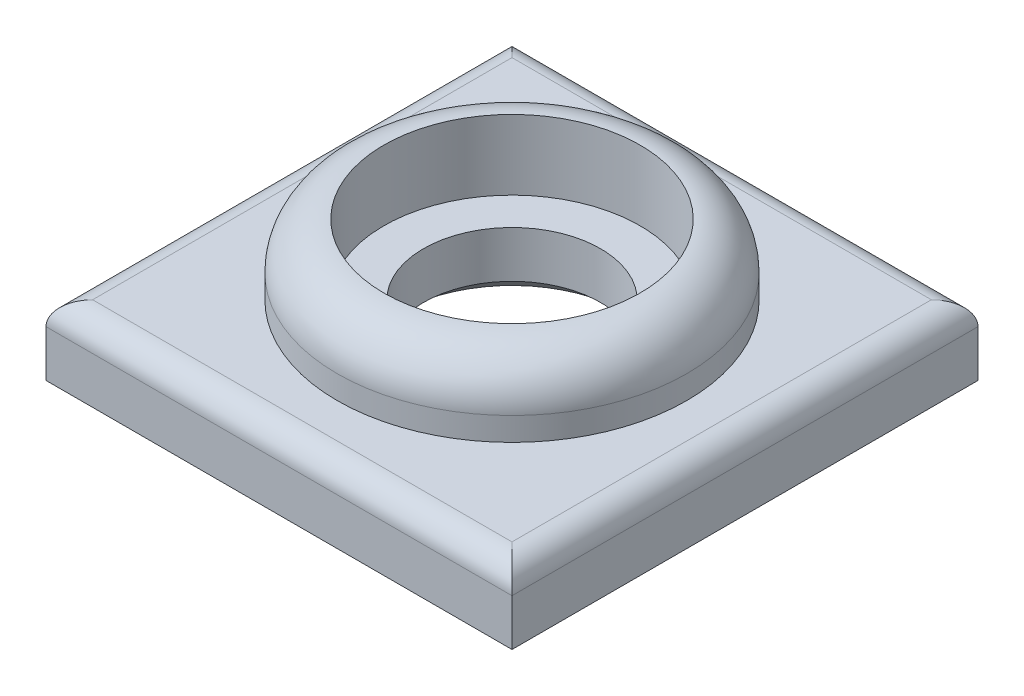
ISO-10303-21;
HEADER;
FILE_DESCRIPTION(('STEP AP214'),'2;1');
FILE_NAME('part.step','',(''),(''),'','','');
FILE_SCHEMA(('AUTOMOTIVE_DESIGN { 1 0 10303 214 1 1 1 1 }'));
ENDSEC;
DATA;
#1=APPLICATION_CONTEXT('core data for automotive mechanical design processes');
#2=APPLICATION_PROTOCOL_DEFINITION('international standard','automotive_design',2000,#1);
#3=PRODUCT_CONTEXT('',#1,'mechanical');
#4=PRODUCT('Part','Part','',(#3));
#5=PRODUCT_RELATED_PRODUCT_CATEGORY('part','',(#4));
#6=PRODUCT_DEFINITION_FORMATION('','',#4);
#7=PRODUCT_DEFINITION_CONTEXT('part definition',#1,'design');
#8=PRODUCT_DEFINITION('design','',#6,#7);
#9=PRODUCT_DEFINITION_SHAPE('','',#8);
#10=(LENGTH_UNIT() NAMED_UNIT(*) SI_UNIT(.MILLI.,.METRE.));
#11=(NAMED_UNIT(*) PLANE_ANGLE_UNIT() SI_UNIT($,.RADIAN.));
#12=(NAMED_UNIT(*) SI_UNIT($,.STERADIAN.) SOLID_ANGLE_UNIT());
#13=UNCERTAINTY_MEASURE_WITH_UNIT(LENGTH_MEASURE(1.E-05),#10,'distance_accuracy_value','');
#14=(GEOMETRIC_REPRESENTATION_CONTEXT(3) GLOBAL_UNCERTAINTY_ASSIGNED_CONTEXT((#13)) GLOBAL_UNIT_ASSIGNED_CONTEXT((#10,
#11,#12)) REPRESENTATION_CONTEXT('',''));
#15=CARTESIAN_POINT('',(0.,0.,0.));
#16=DIRECTION('',(0.,0.,1.));
#17=DIRECTION('',(1.,0.,0.));
#18=AXIS2_PLACEMENT_3D('',#15,#16,#17);
#19=CARTESIAN_POINT('',(0.,3.,0.));
#20=DIRECTION('',(0.,1.,0.));
#21=DIRECTION('',(0.,0.,1.));
#22=AXIS2_PLACEMENT_3D('',#19,#20,#21);
#23=PLANE('',#22);
#24=CARTESIAN_POINT('',(0.,3.,0.));
#25=DIRECTION('',(0.,1.,0.));
#26=DIRECTION('',(0.,0.,1.));
#27=AXIS2_PLACEMENT_3D('',#24,#25,#26);
#28=CIRCLE('',#27,3.8);
#29=CARTESIAN_POINT('',(0.,3.,3.8));
#30=VERTEX_POINT('',#29);
#31=EDGE_CURVE('E114',#30,#30,#28,.T.);
#32=ORIENTED_EDGE('',*,*,#31,.F.);
#33=EDGE_LOOP('',(#32));
#34=FACE_BOUND('',#33,.T.);
#35=CARTESIAN_POINT('',(0.,3.,0.));
#36=DIRECTION('',(0.,1.,0.));
#37=DIRECTION('',(0.,0.,1.));
#38=AXIS2_PLACEMENT_3D('',#35,#36,#37);
#39=CIRCLE('',#38,5.5);
#40=CARTESIAN_POINT('',(0.,3.,5.5));
#41=VERTEX_POINT('',#40);
#42=EDGE_CURVE('E43',#41,#41,#39,.F.);
#43=ORIENTED_EDGE('',*,*,#42,.F.);
#44=EDGE_LOOP('',(#43));
#45=FACE_BOUND('',#44,.T.);
#46=ADVANCED_FACE('F35',(#34,#45),#23,.T.);
#47=CARTESIAN_POINT('',(0.,3.,0.));
#48=DIRECTION('',(0.,1.,0.));
#49=DIRECTION('',(0.,0.,1.));
#50=AXIS2_PLACEMENT_3D('',#47,#48,#49);
#51=CIRCLE('',#50,7.5);
#52=CARTESIAN_POINT('',(0.,3.,7.5));
#53=VERTEX_POINT('',#52);
#54=EDGE_CURVE('E145',#53,#53,#51,.T.);
#55=ORIENTED_EDGE('',*,*,#54,.F.);
#56=EDGE_LOOP('',(#55));
#57=FACE_BOUND('',#56,.T.);
#58=DIRECTION('',(-1.,0.,0.));
#59=VECTOR('',#58,1.);
#60=CARTESIAN_POINT('',(-10.,3.,-9.));
#61=LINE('',#60,#59);
#62=CARTESIAN_POINT('',(9.00000000000001,3.,-9.));
#63=VERTEX_POINT('',#62);
#64=CARTESIAN_POINT('',(-9.,3.,-9.));
#65=VERTEX_POINT('',#64);
#66=EDGE_CURVE('E129',#63,#65,#61,.T.);
#67=ORIENTED_EDGE('',*,*,#66,.T.);
#68=DIRECTION('',(0.,0.,1.));
#69=VECTOR('',#68,1.);
#70=CARTESIAN_POINT('',(-9.,3.,10.));
#71=LINE('',#70,#69);
#72=CARTESIAN_POINT('',(-9.,3.,9.));
#73=VERTEX_POINT('',#72);
#74=EDGE_CURVE('E133',#65,#73,#71,.T.);
#75=ORIENTED_EDGE('',*,*,#74,.T.);
#76=DIRECTION('',(1.,0.,0.));
#77=VECTOR('',#76,1.);
#78=CARTESIAN_POINT('',(10.,3.,9.));
#79=LINE('',#78,#77);
#80=CARTESIAN_POINT('',(9.00000000000001,3.,9.));
#81=VERTEX_POINT('',#80);
#82=EDGE_CURVE('E131',#73,#81,#79,.T.);
#83=ORIENTED_EDGE('',*,*,#82,.T.);
#84=DIRECTION('',(0.,0.,-1.));
#85=VECTOR('',#84,1.);
#86=CARTESIAN_POINT('',(9.00000000000001,3.,-10.));
#87=LINE('',#86,#85);
#88=EDGE_CURVE('E100',#81,#63,#87,.T.);
#89=ORIENTED_EDGE('',*,*,#88,.T.);
#90=EDGE_LOOP('',(#67,#75,#83,#89));
#91=FACE_BOUND('',#90,.T.);
#92=ADVANCED_FACE('F162',(#57,#91),#23,.T.);
#93=CARTESIAN_POINT('',(0.,0.,0.));
#94=DIRECTION('',(0.,1.,0.));
#95=DIRECTION('',(0.,0.,1.));
#96=AXIS2_PLACEMENT_3D('',#93,#94,#95);
#97=PLANE('',#96);
#98=CARTESIAN_POINT('',(0.,0.,0.));
#99=DIRECTION('',(0.,1.,0.));
#100=DIRECTION('',(0.,0.,1.));
#101=AXIS2_PLACEMENT_3D('',#98,#99,#100);
#102=CIRCLE('',#101,4.99175359259421);
#103=CARTESIAN_POINT('',(0.,0.,4.99175359259421));
#104=VERTEX_POINT('',#103);
#105=EDGE_CURVE('E141',#104,#104,#102,.T.);
#106=ORIENTED_EDGE('',*,*,#105,.T.);
#107=EDGE_LOOP('',(#106));
#108=FACE_BOUND('',#107,.T.);
#109=DIRECTION('',(0.,0.,1.));
#110=VECTOR('',#109,1.);
#111=CARTESIAN_POINT('',(-10.,0.,10.));
#112=LINE('',#111,#110);
#113=CARTESIAN_POINT('',(-10.,0.,-10.));
#114=VERTEX_POINT('',#113);
#115=CARTESIAN_POINT('',(-10.,0.,10.));
#116=VERTEX_POINT('',#115);
#117=EDGE_CURVE('E107',#114,#116,#112,.T.);
#118=ORIENTED_EDGE('',*,*,#117,.F.);
#119=DIRECTION('',(-1.,0.,0.));
#120=VECTOR('',#119,1.);
#121=CARTESIAN_POINT('',(10.,0.,-10.));
#122=LINE('',#121,#120);
#123=CARTESIAN_POINT('',(10.,0.,-10.));
#124=VERTEX_POINT('',#123);
#125=EDGE_CURVE('E122',#124,#114,#122,.T.);
#126=ORIENTED_EDGE('',*,*,#125,.F.);
#127=DIRECTION('',(0.,0.,-1.));
#128=VECTOR('',#127,1.);
#129=CARTESIAN_POINT('',(10.,0.,10.));
#130=LINE('',#129,#128);
#131=CARTESIAN_POINT('',(10.,0.,10.));
#132=VERTEX_POINT('',#131);
#133=EDGE_CURVE('E109',#132,#124,#130,.T.);
#134=ORIENTED_EDGE('',*,*,#133,.F.);
#135=DIRECTION('',(1.,0.,0.));
#136=VECTOR('',#135,1.);
#137=CARTESIAN_POINT('',(10.,0.,10.));
#138=LINE('',#137,#136);
#139=EDGE_CURVE('E92',#116,#132,#138,.T.);
#140=ORIENTED_EDGE('',*,*,#139,.F.);
#141=EDGE_LOOP('',(#118,#126,#134,#140));
#142=FACE_BOUND('',#141,.T.);
#143=ADVANCED_FACE('F105',(#108,#142),#97,.F.);
#144=CARTESIAN_POINT('',(-10.,3.,10.));
#145=DIRECTION('',(1.,0.,0.));
#146=DIRECTION('',(0.,0.,-1.));
#147=AXIS2_PLACEMENT_3D('',#144,#145,#146);
#148=PLANE('',#147);
#149=DIRECTION('',(0.,-1.,0.));
#150=VECTOR('',#149,1.);
#151=CARTESIAN_POINT('',(-10.,3.,10.));
#152=LINE('',#151,#150);
#153=CARTESIAN_POINT('',(-10.,2.,10.));
#154=VERTEX_POINT('',#153);
#155=EDGE_CURVE('E89',#154,#116,#152,.T.);
#156=ORIENTED_EDGE('',*,*,#155,.F.);
#157=DIRECTION('',(0.,0.,1.));
#158=VECTOR('',#157,1.);
#159=CARTESIAN_POINT('',(-10.,2.,-10.));
#160=LINE('',#159,#158);
#161=CARTESIAN_POINT('',(-10.,2.,-10.));
#162=VERTEX_POINT('',#161);
#163=EDGE_CURVE('E136',#154,#162,#160,.F.);
#164=ORIENTED_EDGE('',*,*,#163,.T.);
#165=DIRECTION('',(0.,-1.,0.));
#166=VECTOR('',#165,1.);
#167=CARTESIAN_POINT('',(-10.,3.,-10.));
#168=LINE('',#167,#166);
#169=EDGE_CURVE('E112',#162,#114,#168,.T.);
#170=ORIENTED_EDGE('',*,*,#169,.T.);
#171=ORIENTED_EDGE('',*,*,#117,.T.);
#172=EDGE_LOOP('',(#156,#164,#170,#171));
#173=FACE_BOUND('',#172,.T.);
#174=ADVANCED_FACE('F111',(#173),#148,.F.);
#175=CARTESIAN_POINT('',(10.,3.,10.));
#176=DIRECTION('',(0.,0.,-1.));
#177=DIRECTION('',(-1.,0.,0.));
#178=AXIS2_PLACEMENT_3D('',#175,#176,#177);
#179=PLANE('',#178);
#180=DIRECTION('',(0.,-1.,0.));
#181=VECTOR('',#180,1.);
#182=CARTESIAN_POINT('',(10.,3.,10.));
#183=LINE('',#182,#181);
#184=CARTESIAN_POINT('',(10.,2.,10.));
#185=VERTEX_POINT('',#184);
#186=EDGE_CURVE('E101',#185,#132,#183,.T.);
#187=ORIENTED_EDGE('',*,*,#186,.F.);
#188=DIRECTION('',(1.,0.,0.));
#189=VECTOR('',#188,1.);
#190=CARTESIAN_POINT('',(-10.,2.,10.));
#191=LINE('',#190,#189);
#192=EDGE_CURVE('E95',#185,#154,#191,.F.);
#193=ORIENTED_EDGE('',*,*,#192,.T.);
#194=ORIENTED_EDGE('',*,*,#155,.T.);
#195=ORIENTED_EDGE('',*,*,#139,.T.);
#196=EDGE_LOOP('',(#187,#193,#194,#195));
#197=FACE_BOUND('',#196,.T.);
#198=ADVANCED_FACE('F91',(#197),#179,.F.);
#199=CARTESIAN_POINT('',(10.,3.,10.));
#200=DIRECTION('',(-1.,0.,0.));
#201=DIRECTION('',(0.,0.,1.));
#202=AXIS2_PLACEMENT_3D('',#199,#200,#201);
#203=PLANE('',#202);
#204=DIRECTION('',(0.,-1.,0.));
#205=VECTOR('',#204,1.);
#206=CARTESIAN_POINT('',(10.,3.,-10.));
#207=LINE('',#206,#205);
#208=CARTESIAN_POINT('',(10.,2.,-10.));
#209=VERTEX_POINT('',#208);
#210=EDGE_CURVE('E125',#209,#124,#207,.T.);
#211=ORIENTED_EDGE('',*,*,#210,.F.);
#212=DIRECTION('',(0.,0.,-1.));
#213=VECTOR('',#212,1.);
#214=CARTESIAN_POINT('',(10.,2.,10.));
#215=LINE('',#214,#213);
#216=EDGE_CURVE('E57',#209,#185,#215,.F.);
#217=ORIENTED_EDGE('',*,*,#216,.T.);
#218=ORIENTED_EDGE('',*,*,#186,.T.);
#219=ORIENTED_EDGE('',*,*,#133,.T.);
#220=EDGE_LOOP('',(#211,#217,#218,#219));
#221=FACE_BOUND('',#220,.T.);
#222=ADVANCED_FACE('F180',(#221),#203,.F.);
#223=CARTESIAN_POINT('',(10.,3.,-10.));
#224=DIRECTION('',(0.,0.,1.));
#225=DIRECTION('',(1.,0.,0.));
#226=AXIS2_PLACEMENT_3D('',#223,#224,#225);
#227=PLANE('',#226);
#228=ORIENTED_EDGE('',*,*,#169,.F.);
#229=DIRECTION('',(-1.,0.,0.));
#230=VECTOR('',#229,1.);
#231=CARTESIAN_POINT('',(10.,2.,-10.));
#232=LINE('',#231,#230);
#233=EDGE_CURVE('E50',#162,#209,#232,.F.);
#234=ORIENTED_EDGE('',*,*,#233,.T.);
#235=ORIENTED_EDGE('',*,*,#210,.T.);
#236=ORIENTED_EDGE('',*,*,#125,.T.);
#237=EDGE_LOOP('',(#228,#234,#235,#236));
#238=FACE_BOUND('',#237,.T.);
#239=ADVANCED_FACE('F177',(#238),#227,.F.);
#240=CARTESIAN_POINT('',(0.,3.,0.));
#241=DIRECTION('',(0.,-1.,0.));
#242=DIRECTION('',(0.,0.,-1.));
#243=AXIS2_PLACEMENT_3D('',#240,#241,#242);
#244=CYLINDRICAL_SURFACE('',#243,3.8);
#245=CARTESIAN_POINT('',(0.,1.00000000000001,0.));
#246=DIRECTION('',(0.,1.,0.));
#247=DIRECTION('',(0.,0.,1.));
#248=AXIS2_PLACEMENT_3D('',#245,#246,#247);
#249=CIRCLE('',#248,3.8);
#250=CARTESIAN_POINT('',(0.,1.00000000000001,3.8));
#251=VERTEX_POINT('',#250);
#252=EDGE_CURVE('E154',#251,#251,#249,.F.);
#253=ORIENTED_EDGE('',*,*,#252,.T.);
#254=EDGE_LOOP('',(#253));
#255=FACE_BOUND('',#254,.T.);
#256=ORIENTED_EDGE('',*,*,#31,.T.);
#257=EDGE_LOOP('',(#256));
#258=FACE_BOUND('',#257,.T.);
#259=ADVANCED_FACE('F172',(#255,#258),#244,.F.);
#260=CARTESIAN_POINT('',(9.00000000000001,2.,0.));
#261=DIRECTION('',(0.,0.,1.));
#262=DIRECTION('',(1.,0.,0.));
#263=AXIS2_PLACEMENT_3D('',#260,#261,#262);
#264=CYLINDRICAL_SURFACE('',#263,1.);
#265=CARTESIAN_POINT('',(9.00000000000001,2.,9.));
#266=DIRECTION('',(-0.707106781186547,0.,0.707106781186547));
#267=DIRECTION('',(0.707106781186548,0.,0.707106781186547));
#268=AXIS2_PLACEMENT_3D('',#265,#266,#267);
#269=ELLIPSE('',#268,1.41421356237309,1.);
#270=EDGE_CURVE('E147',#185,#81,#269,.T.);
#271=ORIENTED_EDGE('',*,*,#270,.F.);
#272=ORIENTED_EDGE('',*,*,#216,.F.);
#273=CARTESIAN_POINT('',(9.00000000000001,2.,-9.));
#274=DIRECTION('',(0.707106781186548,0.,0.707106781186547));
#275=DIRECTION('',(-0.707106781186547,0.,0.707106781186547));
#276=AXIS2_PLACEMENT_3D('',#273,#274,#275);
#277=ELLIPSE('',#276,1.4142135623731,1.);
#278=EDGE_CURVE('E117',#63,#209,#277,.F.);
#279=ORIENTED_EDGE('',*,*,#278,.F.);
#280=ORIENTED_EDGE('',*,*,#88,.F.);
#281=EDGE_LOOP('',(#271,#272,#279,#280));
#282=FACE_BOUND('',#281,.T.);
#283=ADVANCED_FACE('F199',(#282),#264,.T.);
#284=CARTESIAN_POINT('',(0.,2.,-9.));
#285=DIRECTION('',(1.,0.,0.));
#286=DIRECTION('',(0.,0.,-1.));
#287=AXIS2_PLACEMENT_3D('',#284,#285,#286);
#288=CYLINDRICAL_SURFACE('',#287,1.);
#289=ORIENTED_EDGE('',*,*,#278,.T.);
#290=ORIENTED_EDGE('',*,*,#233,.F.);
#291=CARTESIAN_POINT('',(-9.,2.,-9.));
#292=DIRECTION('',(0.707106781186547,0.,-0.707106781186547));
#293=DIRECTION('',(0.707106781186548,0.,0.707106781186547));
#294=AXIS2_PLACEMENT_3D('',#291,#292,#293);
#295=ELLIPSE('',#294,1.41421356237309,1.);
#296=EDGE_CURVE('E144',#65,#162,#295,.F.);
#297=ORIENTED_EDGE('',*,*,#296,.F.);
#298=ORIENTED_EDGE('',*,*,#66,.F.);
#299=EDGE_LOOP('',(#289,#290,#297,#298));
#300=FACE_BOUND('',#299,.T.);
#301=ADVANCED_FACE('F195',(#300),#288,.T.);
#302=CARTESIAN_POINT('',(0.,2.,9.));
#303=DIRECTION('',(-1.,0.,0.));
#304=DIRECTION('',(0.,0.,1.));
#305=AXIS2_PLACEMENT_3D('',#302,#303,#304);
#306=CYLINDRICAL_SURFACE('',#305,1.);
#307=ORIENTED_EDGE('',*,*,#270,.T.);
#308=ORIENTED_EDGE('',*,*,#82,.F.);
#309=CARTESIAN_POINT('',(-9.,2.,9.));
#310=DIRECTION('',(-0.707106781186548,0.,-0.707106781186547));
#311=DIRECTION('',(-0.707106781186547,0.,0.707106781186547));
#312=AXIS2_PLACEMENT_3D('',#309,#310,#311);
#313=ELLIPSE('',#312,1.4142135623731,1.);
#314=EDGE_CURVE('E142',#154,#73,#313,.T.);
#315=ORIENTED_EDGE('',*,*,#314,.F.);
#316=ORIENTED_EDGE('',*,*,#192,.F.);
#317=EDGE_LOOP('',(#307,#308,#315,#316));
#318=FACE_BOUND('',#317,.T.);
#319=ADVANCED_FACE('F191',(#318),#306,.T.);
#320=CARTESIAN_POINT('',(-9.,2.,0.));
#321=DIRECTION('',(0.,0.,-1.));
#322=DIRECTION('',(-1.,0.,0.));
#323=AXIS2_PLACEMENT_3D('',#320,#321,#322);
#324=CYLINDRICAL_SURFACE('',#323,1.);
#325=ORIENTED_EDGE('',*,*,#296,.T.);
#326=ORIENTED_EDGE('',*,*,#163,.F.);
#327=ORIENTED_EDGE('',*,*,#314,.T.);
#328=ORIENTED_EDGE('',*,*,#74,.F.);
#329=EDGE_LOOP('',(#325,#326,#327,#328));
#330=FACE_BOUND('',#329,.T.);
#331=ADVANCED_FACE('F187',(#330),#324,.T.);
#332=CARTESIAN_POINT('',(0.,0.,0.));
#333=DIRECTION('',(0.,-1.,0.));
#334=DIRECTION('',(0.,0.,-1.));
#335=AXIS2_PLACEMENT_3D('',#332,#333,#334);
#336=CONICAL_SURFACE('',#335,4.99175359259421,0.872664625997163);
#337=ORIENTED_EDGE('',*,*,#252,.F.);
#338=EDGE_LOOP('',(#337));
#339=FACE_BOUND('',#338,.T.);
#340=ORIENTED_EDGE('',*,*,#105,.F.);
#341=EDGE_LOOP('',(#340));
#342=FACE_BOUND('',#341,.T.);
#343=ADVANCED_FACE('F190',(#339,#342),#336,.F.);
#344=CARTESIAN_POINT('',(0.,6.,0.));
#345=DIRECTION('',(0.,-1.,0.));
#346=DIRECTION('',(0.,0.,-1.));
#347=AXIS2_PLACEMENT_3D('',#344,#345,#346);
#348=CYLINDRICAL_SURFACE('',#347,7.5);
#349=CARTESIAN_POINT('',(0.,4.,0.));
#350=DIRECTION('',(0.,1.,0.));
#351=DIRECTION('',(0.,0.,1.));
#352=AXIS2_PLACEMENT_3D('',#349,#350,#351);
#353=CIRCLE('',#352,7.5);
#354=CARTESIAN_POINT('',(0.,4.,7.5));
#355=VERTEX_POINT('',#354);
#356=EDGE_CURVE('E11',#355,#355,#353,.F.);
#357=ORIENTED_EDGE('',*,*,#356,.T.);
#358=EDGE_LOOP('',(#357));
#359=FACE_BOUND('',#358,.T.);
#360=ORIENTED_EDGE('',*,*,#54,.T.);
#361=EDGE_LOOP('',(#360));
#362=FACE_BOUND('',#361,.T.);
#363=ADVANCED_FACE('F204',(#359,#362),#348,.T.);
#364=CARTESIAN_POINT('',(0.,6.,0.));
#365=DIRECTION('',(0.,-1.,0.));
#366=DIRECTION('',(0.,0.,-1.));
#367=AXIS2_PLACEMENT_3D('',#364,#365,#366);
#368=CYLINDRICAL_SURFACE('',#367,5.5);
#369=CARTESIAN_POINT('',(0.,6.,0.));
#370=DIRECTION('',(0.,1.,0.));
#371=DIRECTION('',(0.,0.,1.));
#372=AXIS2_PLACEMENT_3D('',#369,#370,#371);
#373=CIRCLE('',#372,5.5);
#374=CARTESIAN_POINT('',(0.,6.,5.5));
#375=VERTEX_POINT('',#374);
#376=EDGE_CURVE('E312',#375,#375,#373,.T.);
#377=ORIENTED_EDGE('',*,*,#376,.T.);
#378=EDGE_LOOP('',(#377));
#379=FACE_BOUND('',#378,.T.);
#380=ORIENTED_EDGE('',*,*,#42,.T.);
#381=EDGE_LOOP('',(#380));
#382=FACE_BOUND('',#381,.T.);
#383=ADVANCED_FACE('F159',(#379,#382),#368,.F.);
#384=CARTESIAN_POINT('',(0.,4.,0.));
#385=DIRECTION('',(0.,1.,0.));
#386=DIRECTION('',(0.,0.,1.));
#387=AXIS2_PLACEMENT_3D('',#384,#385,#386);
#388=TOROIDAL_SURFACE('',#387,5.5,2.);
#389=ORIENTED_EDGE('',*,*,#356,.F.);
#390=EDGE_LOOP('',(#389));
#391=FACE_BOUND('',#390,.T.);
#392=ORIENTED_EDGE('',*,*,#376,.F.);
#393=EDGE_LOOP('',(#392));
#394=FACE_BOUND('',#393,.T.);
#395=ADVANCED_FACE('F37',(#391,#394),#388,.T.);
#396=CLOSED_SHELL('',(#46,#92,#143,#174,#198,#222,#239,#259,#283,#301,#319,#331,#343,#363,#383,#395));
#397=MANIFOLD_SOLID_BREP('B2',#396);
#398=ADVANCED_BREP_SHAPE_REPRESENTATION('',(#18,#397),#14);
#399=SHAPE_DEFINITION_REPRESENTATION(#9,#398);
ENDSEC;
END-ISO-10303-21;
